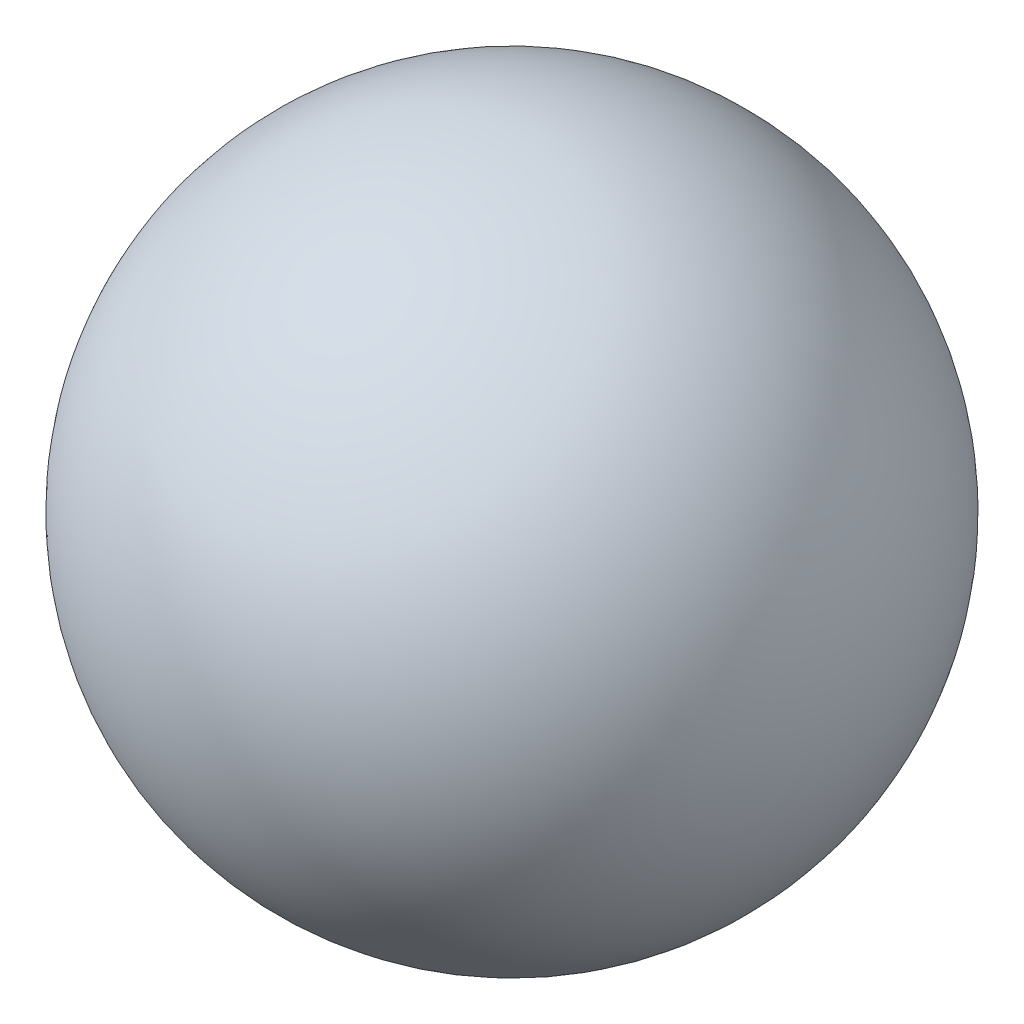
ISO-10303-21;
HEADER;
FILE_DESCRIPTION(('STEP AP214'),'2;1');
FILE_NAME('part.step','',(''),(''),'','','');
FILE_SCHEMA(('AUTOMOTIVE_DESIGN { 1 0 10303 214 1 1 1 1 }'));
ENDSEC;
DATA;
#1=APPLICATION_CONTEXT('core data for automotive mechanical design processes');
#2=APPLICATION_PROTOCOL_DEFINITION('international standard','automotive_design',2000,#1);
#3=PRODUCT_CONTEXT('',#1,'mechanical');
#4=PRODUCT('Part','Part','',(#3));
#5=PRODUCT_RELATED_PRODUCT_CATEGORY('part','',(#4));
#6=PRODUCT_DEFINITION_FORMATION('','',#4);
#7=PRODUCT_DEFINITION_CONTEXT('part definition',#1,'design');
#8=PRODUCT_DEFINITION('design','',#6,#7);
#9=PRODUCT_DEFINITION_SHAPE('','',#8);
#10=(LENGTH_UNIT() NAMED_UNIT(*) SI_UNIT(.MILLI.,.METRE.));
#11=(NAMED_UNIT(*) PLANE_ANGLE_UNIT() SI_UNIT($,.RADIAN.));
#12=(NAMED_UNIT(*) SI_UNIT($,.STERADIAN.) SOLID_ANGLE_UNIT());
#13=UNCERTAINTY_MEASURE_WITH_UNIT(LENGTH_MEASURE(1.E-05),#10,'distance_accuracy_value','');
#14=(GEOMETRIC_REPRESENTATION_CONTEXT(3) GLOBAL_UNCERTAINTY_ASSIGNED_CONTEXT((#13)) GLOBAL_UNIT_ASSIGNED_CONTEXT((#10,
#11,#12)) REPRESENTATION_CONTEXT('',''));
#15=CARTESIAN_POINT('',(0.,0.,0.));
#16=DIRECTION('',(0.,0.,1.));
#17=DIRECTION('',(1.,0.,0.));
#18=AXIS2_PLACEMENT_3D('',#15,#16,#17);
#19=CARTESIAN_POINT('',(0.,0.,0.));
#20=DIRECTION('',(-1.,0.,0.));
#21=DIRECTION('',(0.,1.,0.));
#22=AXIS2_PLACEMENT_3D('',#19,#20,#21);
#23=SPHERICAL_SURFACE('',#22,9.);
#24=CARTESIAN_POINT('',(-9.,0.,0.));
#25=VERTEX_POINT('',#24);
#26=VERTEX_LOOP('',#25);
#27=FACE_BOUND('',#26,.T.);
#28=ADVANCED_FACE('F33',(#27),#23,.T.);
#29=CLOSED_SHELL('',(#28));
#30=MANIFOLD_SOLID_BREP('B2',#29);
#31=ADVANCED_BREP_SHAPE_REPRESENTATION('',(#18,#30),#14);
#32=SHAPE_DEFINITION_REPRESENTATION(#9,#31);
ENDSEC;
END-ISO-10303-21;
